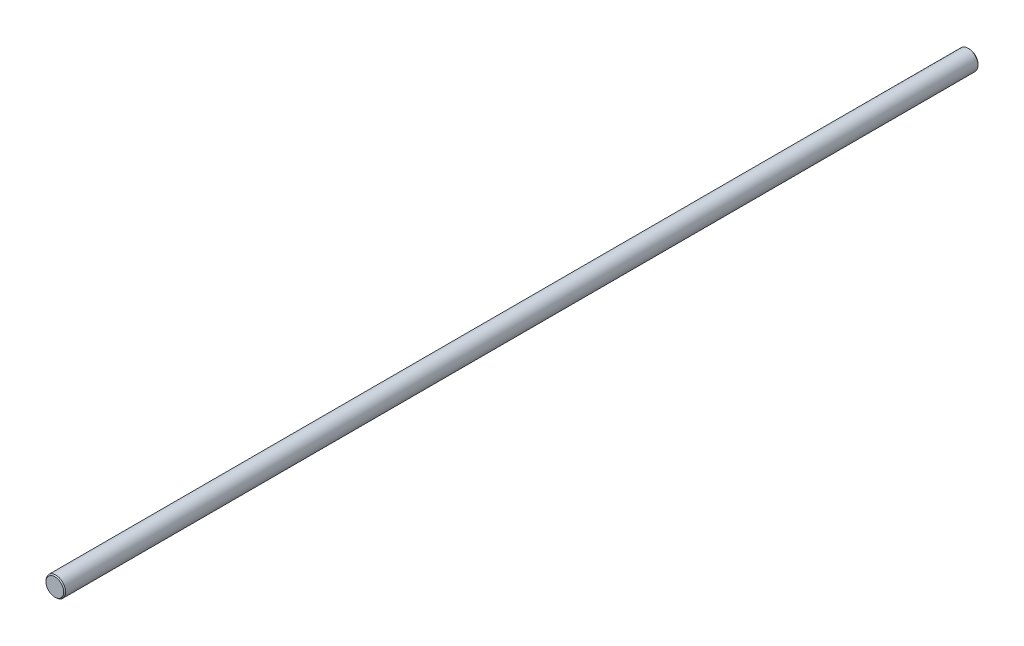
ISO-10303-21;
HEADER;
FILE_DESCRIPTION(('STEP AP214'),'2;1');
FILE_NAME('part.step','',(''),(''),'','','');
FILE_SCHEMA(('AUTOMOTIVE_DESIGN { 1 0 10303 214 1 1 1 1 }'));
ENDSEC;
DATA;
#1=APPLICATION_CONTEXT('core data for automotive mechanical design processes');
#2=APPLICATION_PROTOCOL_DEFINITION('international standard','automotive_design',2000,#1);
#3=PRODUCT_CONTEXT('',#1,'mechanical');
#4=PRODUCT('Part','Part','',(#3));
#5=PRODUCT_RELATED_PRODUCT_CATEGORY('part','',(#4));
#6=PRODUCT_DEFINITION_FORMATION('','',#4);
#7=PRODUCT_DEFINITION_CONTEXT('part definition',#1,'design');
#8=PRODUCT_DEFINITION('design','',#6,#7);
#9=PRODUCT_DEFINITION_SHAPE('','',#8);
#10=(LENGTH_UNIT() NAMED_UNIT(*) SI_UNIT(.MILLI.,.METRE.));
#11=(NAMED_UNIT(*) PLANE_ANGLE_UNIT() SI_UNIT($,.RADIAN.));
#12=(NAMED_UNIT(*) SI_UNIT($,.STERADIAN.) SOLID_ANGLE_UNIT());
#13=UNCERTAINTY_MEASURE_WITH_UNIT(LENGTH_MEASURE(1.E-05),#10,'distance_accuracy_value','');
#14=(GEOMETRIC_REPRESENTATION_CONTEXT(3) GLOBAL_UNCERTAINTY_ASSIGNED_CONTEXT((#13)) GLOBAL_UNIT_ASSIGNED_CONTEXT((#10,
#11,#12)) REPRESENTATION_CONTEXT('',''));
#15=CARTESIAN_POINT('',(0.,0.,0.));
#16=DIRECTION('',(0.,0.,1.));
#17=DIRECTION('',(1.,0.,0.));
#18=AXIS2_PLACEMENT_3D('',#15,#16,#17);
#19=CARTESIAN_POINT('',(0.,0.,465.));
#20=DIRECTION('',(0.,0.,-1.));
#21=DIRECTION('',(-1.,0.,0.));
#22=AXIS2_PLACEMENT_3D('',#19,#20,#21);
#23=CYLINDRICAL_SURFACE('',#22,5.);
#24=CARTESIAN_POINT('',(0.,0.,0.499999999999945));
#25=DIRECTION('',(0.,0.,1.));
#26=DIRECTION('',(1.,0.,0.));
#27=AXIS2_PLACEMENT_3D('',#24,#25,#26);
#28=CIRCLE('',#27,5.);
#29=CARTESIAN_POINT('',(5.,0.,0.499999999999945));
#30=VERTEX_POINT('',#29);
#31=EDGE_CURVE('E39',#30,#30,#28,.T.);
#32=ORIENTED_EDGE('',*,*,#31,.T.);
#33=EDGE_LOOP('',(#32));
#34=FACE_BOUND('',#33,.T.);
#35=CARTESIAN_POINT('',(0.,0.,464.5));
#36=DIRECTION('',(0.,0.,1.));
#37=DIRECTION('',(1.,0.,0.));
#38=AXIS2_PLACEMENT_3D('',#35,#36,#37);
#39=CIRCLE('',#38,5.);
#40=CARTESIAN_POINT('',(5.,0.,464.5));
#41=VERTEX_POINT('',#40);
#42=EDGE_CURVE('E43',#41,#41,#39,.F.);
#43=ORIENTED_EDGE('',*,*,#42,.T.);
#44=EDGE_LOOP('',(#43));
#45=FACE_BOUND('',#44,.T.);
#46=ADVANCED_FACE('F32',(#34,#45),#23,.T.);
#47=CARTESIAN_POINT('',(0.,0.,465.));
#48=DIRECTION('',(0.,0.,1.));
#49=DIRECTION('',(1.,0.,0.));
#50=AXIS2_PLACEMENT_3D('',#47,#48,#49);
#51=PLANE('',#50);
#52=CARTESIAN_POINT('',(0.,0.,465.));
#53=DIRECTION('',(0.,0.,1.));
#54=DIRECTION('',(1.,0.,0.));
#55=AXIS2_PLACEMENT_3D('',#52,#53,#54);
#56=CIRCLE('',#55,4.50000000000006);
#57=CARTESIAN_POINT('',(4.50000000000006,0.,465.));
#58=VERTEX_POINT('',#57);
#59=EDGE_CURVE('E47',#58,#58,#56,.T.);
#60=ORIENTED_EDGE('',*,*,#59,.T.);
#61=EDGE_LOOP('',(#60));
#62=FACE_BOUND('',#61,.T.);
#63=ADVANCED_FACE('F53',(#62),#51,.T.);
#64=CARTESIAN_POINT('',(0.,0.,0.));
#65=DIRECTION('',(0.,0.,1.));
#66=DIRECTION('',(1.,0.,0.));
#67=AXIS2_PLACEMENT_3D('',#64,#65,#66);
#68=PLANE('',#67);
#69=CARTESIAN_POINT('',(0.,0.,0.));
#70=DIRECTION('',(0.,0.,1.));
#71=DIRECTION('',(1.,0.,0.));
#72=AXIS2_PLACEMENT_3D('',#69,#70,#71);
#73=CIRCLE('',#72,4.50000000000006);
#74=CARTESIAN_POINT('',(4.50000000000006,0.,0.));
#75=VERTEX_POINT('',#74);
#76=EDGE_CURVE('E10',#75,#75,#73,.F.);
#77=ORIENTED_EDGE('',*,*,#76,.T.);
#78=EDGE_LOOP('',(#77));
#79=FACE_BOUND('',#78,.T.);
#80=ADVANCED_FACE('F57',(#79),#68,.F.);
#81=CARTESIAN_POINT('',(0.,0.,465.));
#82=DIRECTION('',(0.,0.,-1.));
#83=DIRECTION('',(-1.,0.,0.));
#84=AXIS2_PLACEMENT_3D('',#81,#82,#83);
#85=CONICAL_SURFACE('',#84,4.50000000000006,0.785398163397499);
#86=ORIENTED_EDGE('',*,*,#42,.F.);
#87=EDGE_LOOP('',(#86));
#88=FACE_BOUND('',#87,.T.);
#89=ORIENTED_EDGE('',*,*,#59,.F.);
#90=EDGE_LOOP('',(#89));
#91=FACE_BOUND('',#90,.T.);
#92=ADVANCED_FACE('F55',(#88,#91),#85,.T.);
#93=CARTESIAN_POINT('',(0.,0.,0.499999999999945));
#94=DIRECTION('',(0.,0.,1.));
#95=DIRECTION('',(1.,0.,0.));
#96=AXIS2_PLACEMENT_3D('',#93,#94,#95);
#97=CONICAL_SURFACE('',#96,5.,0.785398163397444);
#98=ORIENTED_EDGE('',*,*,#76,.F.);
#99=EDGE_LOOP('',(#98));
#100=FACE_BOUND('',#99,.T.);
#101=ORIENTED_EDGE('',*,*,#31,.F.);
#102=EDGE_LOOP('',(#101));
#103=FACE_BOUND('',#102,.T.);
#104=ADVANCED_FACE('F34',(#100,#103),#97,.T.);
#105=CLOSED_SHELL('',(#46,#63,#80,#92,#104));
#106=MANIFOLD_SOLID_BREP('B2',#105);
#107=ADVANCED_BREP_SHAPE_REPRESENTATION('',(#18,#106),#14);
#108=SHAPE_DEFINITION_REPRESENTATION(#9,#107);
ENDSEC;
END-ISO-10303-21;
